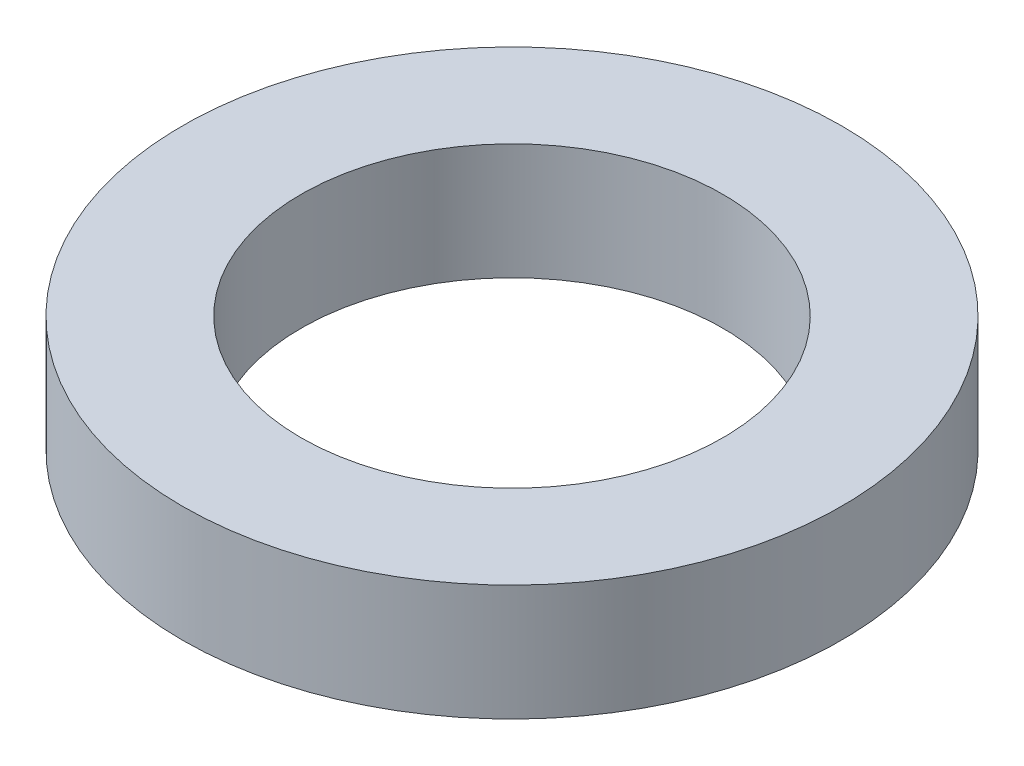
ISO-10303-21;
HEADER;
FILE_DESCRIPTION(('STEP AP214'),'2;1');
FILE_NAME('part.step','',(''),(''),'','','');
FILE_SCHEMA(('AUTOMOTIVE_DESIGN { 1 0 10303 214 1 1 1 1 }'));
ENDSEC;
DATA;
#1=APPLICATION_CONTEXT('core data for automotive mechanical design processes');
#2=APPLICATION_PROTOCOL_DEFINITION('international standard','automotive_design',2000,#1);
#3=PRODUCT_CONTEXT('',#1,'mechanical');
#4=PRODUCT('Part','Part','',(#3));
#5=PRODUCT_RELATED_PRODUCT_CATEGORY('part','',(#4));
#6=PRODUCT_DEFINITION_FORMATION('','',#4);
#7=PRODUCT_DEFINITION_CONTEXT('part definition',#1,'design');
#8=PRODUCT_DEFINITION('design','',#6,#7);
#9=PRODUCT_DEFINITION_SHAPE('','',#8);
#10=(LENGTH_UNIT() NAMED_UNIT(*) SI_UNIT(.MILLI.,.METRE.));
#11=(NAMED_UNIT(*) PLANE_ANGLE_UNIT() SI_UNIT($,.RADIAN.));
#12=(NAMED_UNIT(*) SI_UNIT($,.STERADIAN.) SOLID_ANGLE_UNIT());
#13=UNCERTAINTY_MEASURE_WITH_UNIT(LENGTH_MEASURE(1.E-05),#10,'distance_accuracy_value','');
#14=(GEOMETRIC_REPRESENTATION_CONTEXT(3) GLOBAL_UNCERTAINTY_ASSIGNED_CONTEXT((#13)) GLOBAL_UNIT_ASSIGNED_CONTEXT((#10,
#11,#12)) REPRESENTATION_CONTEXT('',''));
#15=CARTESIAN_POINT('',(0.,0.,0.));
#16=DIRECTION('',(0.,0.,1.));
#17=DIRECTION('',(1.,0.,0.));
#18=AXIS2_PLACEMENT_3D('',#15,#16,#17);
#19=CARTESIAN_POINT('',(0.,22.,0.));
#20=DIRECTION('',(0.,-1.,0.));
#21=DIRECTION('',(0.,0.,-1.));
#22=AXIS2_PLACEMENT_3D('',#19,#20,#21);
#23=CYLINDRICAL_SURFACE('',#22,62.5);
#24=CARTESIAN_POINT('',(0.,22.,0.));
#25=DIRECTION('',(0.,1.,0.));
#26=DIRECTION('',(0.,0.,1.));
#27=AXIS2_PLACEMENT_3D('',#24,#25,#26);
#28=CIRCLE('',#27,62.5);
#29=CARTESIAN_POINT('',(0.,22.,62.5));
#30=VERTEX_POINT('',#29);
#31=EDGE_CURVE('E10',#30,#30,#28,.T.);
#32=ORIENTED_EDGE('',*,*,#31,.F.);
#33=EDGE_LOOP('',(#32));
#34=FACE_BOUND('',#33,.T.);
#35=CARTESIAN_POINT('',(0.,0.,0.));
#36=DIRECTION('',(0.,1.,0.));
#37=DIRECTION('',(0.,0.,1.));
#38=AXIS2_PLACEMENT_3D('',#35,#36,#37);
#39=CIRCLE('',#38,62.5);
#40=CARTESIAN_POINT('',(0.,0.,62.5));
#41=VERTEX_POINT('',#40);
#42=EDGE_CURVE('E37',#41,#41,#39,.T.);
#43=ORIENTED_EDGE('',*,*,#42,.T.);
#44=EDGE_LOOP('',(#43));
#45=FACE_BOUND('',#44,.T.);
#46=ADVANCED_FACE('F40',(#34,#45),#23,.T.);
#47=CARTESIAN_POINT('',(0.,22.,0.));
#48=DIRECTION('',(0.,1.,0.));
#49=DIRECTION('',(0.,0.,1.));
#50=AXIS2_PLACEMENT_3D('',#47,#48,#49);
#51=PLANE('',#50);
#52=CARTESIAN_POINT('',(0.,22.,0.));
#53=DIRECTION('',(0.,1.,0.));
#54=DIRECTION('',(0.,0.,1.));
#55=AXIS2_PLACEMENT_3D('',#52,#53,#54);
#56=CIRCLE('',#55,40.);
#57=CARTESIAN_POINT('',(0.,22.,40.));
#58=VERTEX_POINT('',#57);
#59=EDGE_CURVE('E50',#58,#58,#56,.T.);
#60=ORIENTED_EDGE('',*,*,#59,.F.);
#61=EDGE_LOOP('',(#60));
#62=FACE_BOUND('',#61,.T.);
#63=ORIENTED_EDGE('',*,*,#31,.T.);
#64=EDGE_LOOP('',(#63));
#65=FACE_BOUND('',#64,.T.);
#66=ADVANCED_FACE('F59',(#62,#65),#51,.T.);
#67=CARTESIAN_POINT('',(0.,0.,0.));
#68=DIRECTION('',(0.,1.,0.));
#69=DIRECTION('',(0.,0.,1.));
#70=AXIS2_PLACEMENT_3D('',#67,#68,#69);
#71=PLANE('',#70);
#72=CARTESIAN_POINT('',(0.,0.,0.));
#73=DIRECTION('',(0.,1.,0.));
#74=DIRECTION('',(0.,0.,1.));
#75=AXIS2_PLACEMENT_3D('',#72,#73,#74);
#76=CIRCLE('',#75,40.);
#77=CARTESIAN_POINT('',(0.,0.,40.));
#78=VERTEX_POINT('',#77);
#79=EDGE_CURVE('E47',#78,#78,#76,.T.);
#80=ORIENTED_EDGE('',*,*,#79,.T.);
#81=EDGE_LOOP('',(#80));
#82=FACE_BOUND('',#81,.T.);
#83=ORIENTED_EDGE('',*,*,#42,.F.);
#84=EDGE_LOOP('',(#83));
#85=FACE_BOUND('',#84,.T.);
#86=ADVANCED_FACE('F58',(#82,#85),#71,.F.);
#87=CARTESIAN_POINT('',(0.,22.,0.));
#88=DIRECTION('',(0.,-1.,0.));
#89=DIRECTION('',(0.,0.,-1.));
#90=AXIS2_PLACEMENT_3D('',#87,#88,#89);
#91=CYLINDRICAL_SURFACE('',#90,40.);
#92=ORIENTED_EDGE('',*,*,#59,.T.);
#93=EDGE_LOOP('',(#92));
#94=FACE_BOUND('',#93,.T.);
#95=ORIENTED_EDGE('',*,*,#79,.F.);
#96=EDGE_LOOP('',(#95));
#97=FACE_BOUND('',#96,.T.);
#98=ADVANCED_FACE('F54',(#94,#97),#91,.F.);
#99=CLOSED_SHELL('',(#46,#66,#86,#98));
#100=MANIFOLD_SOLID_BREP('B2',#99);
#101=ADVANCED_BREP_SHAPE_REPRESENTATION('',(#18,#100),#14);
#102=SHAPE_DEFINITION_REPRESENTATION(#9,#101);
ENDSEC;
END-ISO-10303-21;
